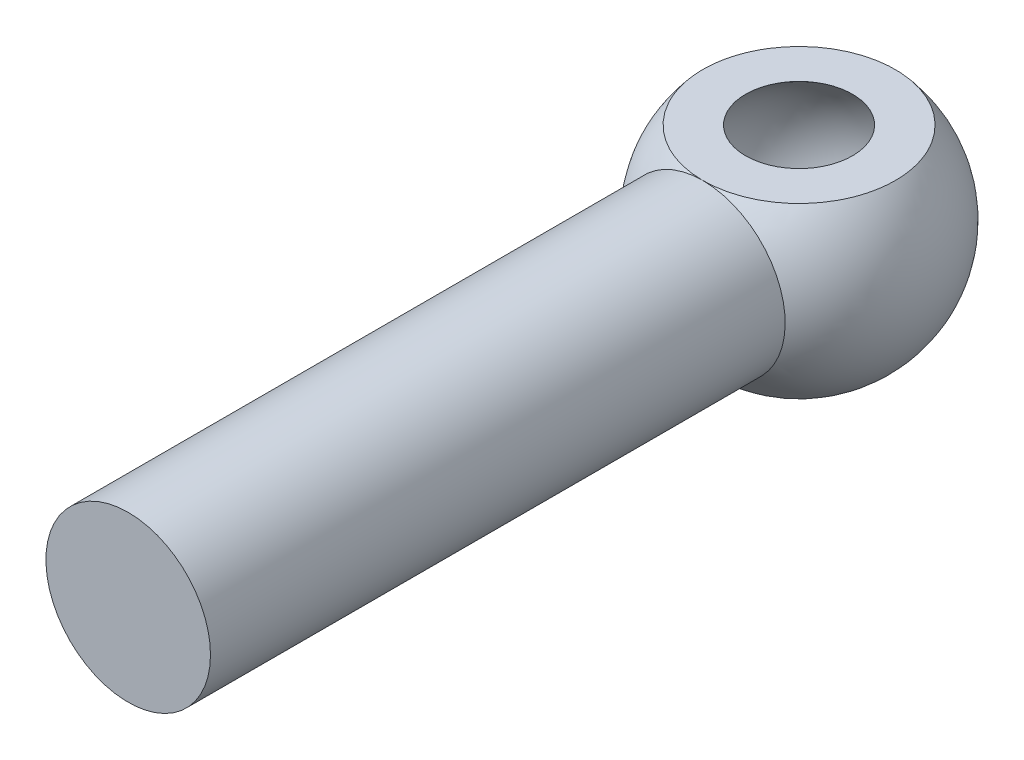
ISO-10303-21;
HEADER;
FILE_DESCRIPTION(('STEP AP214'),'2;1');
FILE_NAME('part.step','',(''),(''),'','','');
FILE_SCHEMA(('AUTOMOTIVE_DESIGN { 1 0 10303 214 1 1 1 1 }'));
ENDSEC;
DATA;
#1=APPLICATION_CONTEXT('core data for automotive mechanical design processes');
#2=APPLICATION_PROTOCOL_DEFINITION('international standard','automotive_design',2000,#1);
#3=PRODUCT_CONTEXT('',#1,'mechanical');
#4=PRODUCT('Part','Part','',(#3));
#5=PRODUCT_RELATED_PRODUCT_CATEGORY('part','',(#4));
#6=PRODUCT_DEFINITION_FORMATION('','',#4);
#7=PRODUCT_DEFINITION_CONTEXT('part definition',#1,'design');
#8=PRODUCT_DEFINITION('design','',#6,#7);
#9=PRODUCT_DEFINITION_SHAPE('','',#8);
#10=(LENGTH_UNIT() NAMED_UNIT(*) SI_UNIT(.MILLI.,.METRE.));
#11=(NAMED_UNIT(*) PLANE_ANGLE_UNIT() SI_UNIT($,.RADIAN.));
#12=(NAMED_UNIT(*) SI_UNIT($,.STERADIAN.) SOLID_ANGLE_UNIT());
#13=UNCERTAINTY_MEASURE_WITH_UNIT(LENGTH_MEASURE(1.E-05),#10,'distance_accuracy_value','');
#14=(GEOMETRIC_REPRESENTATION_CONTEXT(3) GLOBAL_UNCERTAINTY_ASSIGNED_CONTEXT((#13)) GLOBAL_UNIT_ASSIGNED_CONTEXT((#10,
#11,#12)) REPRESENTATION_CONTEXT('',''));
#15=CARTESIAN_POINT('',(0.,0.,0.));
#16=DIRECTION('',(0.,0.,1.));
#17=DIRECTION('',(1.,0.,0.));
#18=AXIS2_PLACEMENT_3D('',#15,#16,#17);
#19=CARTESIAN_POINT('',(0.,1.651,0.));
#20=DIRECTION('',(0.,1.,0.));
#21=DIRECTION('',(0.,0.,1.));
#22=AXIS2_PLACEMENT_3D('',#19,#20,#21);
#23=PLANE('',#22);
#24=CARTESIAN_POINT('',(0.,1.651,0.));
#25=DIRECTION('',(0.,1.,0.));
#26=DIRECTION('',(0.,0.,1.));
#27=AXIS2_PLACEMENT_3D('',#24,#25,#26);
#28=CIRCLE('',#27,1.93023288750347);
#29=CARTESIAN_POINT('',(0.,1.651,1.93023288750347));
#30=VERTEX_POINT('',#29);
#31=EDGE_CURVE('E44',#30,#30,#28,.F.);
#32=ORIENTED_EDGE('',*,*,#31,.F.);
#33=EDGE_LOOP('',(#32));
#34=FACE_BOUND('',#33,.T.);
#35=CARTESIAN_POINT('',(0.,1.651,0.));
#36=DIRECTION('',(0.,1.,0.));
#37=DIRECTION('',(0.,0.,1.));
#38=AXIS2_PLACEMENT_3D('',#35,#36,#37);
#39=CIRCLE('',#38,1.07200338152452);
#40=CARTESIAN_POINT('',(0.,1.651,1.07200338152452));
#41=VERTEX_POINT('',#40);
#42=EDGE_CURVE('E35',#41,#41,#39,.F.);
#43=ORIENTED_EDGE('',*,*,#42,.T.);
#44=EDGE_LOOP('',(#43));
#45=FACE_BOUND('',#44,.T.);
#46=ADVANCED_FACE('F31',(#34,#45),#23,.T.);
#47=CARTESIAN_POINT('',(0.,0.,0.));
#48=DIRECTION('',(-1.,0.,0.));
#49=DIRECTION('',(0.,-1.,0.));
#50=AXIS2_PLACEMENT_3D('',#47,#48,#49);
#51=SPHERICAL_SURFACE('',#50,2.54);
#52=CARTESIAN_POINT('',(0.,0.,1.93023288750347));
#53=DIRECTION('',(0.,0.,-1.));
#54=DIRECTION('',(-1.,0.,0.));
#55=AXIS2_PLACEMENT_3D('',#52,#53,#54);
#56=CIRCLE('',#55,1.651);
#57=EDGE_CURVE('E39',#30,#30,#56,.F.);
#58=ORIENTED_EDGE('',*,*,#57,.F.);
#59=ORIENTED_EDGE('',*,*,#31,.T.);
#60=EDGE_LOOP('',(#58,#59));
#61=FACE_BOUND('',#60,.T.);
#62=ADVANCED_FACE('F63',(#61),#51,.T.);
#63=CARTESIAN_POINT('',(0.,0.,13.462));
#64=DIRECTION('',(0.,0.,-1.));
#65=DIRECTION('',(-1.,0.,0.));
#66=AXIS2_PLACEMENT_3D('',#63,#64,#65);
#67=CYLINDRICAL_SURFACE('',#66,1.651);
#68=ORIENTED_EDGE('',*,*,#57,.T.);
#69=EDGE_LOOP('',(#68));
#70=FACE_BOUND('',#69,.T.);
#71=CARTESIAN_POINT('',(0.,0.,13.462));
#72=DIRECTION('',(0.,0.,1.));
#73=DIRECTION('',(1.,0.,0.));
#74=AXIS2_PLACEMENT_3D('',#71,#72,#73);
#75=CIRCLE('',#74,1.651);
#76=CARTESIAN_POINT('',(1.651,0.,13.462));
#77=VERTEX_POINT('',#76);
#78=EDGE_CURVE('E11',#77,#77,#75,.T.);
#79=ORIENTED_EDGE('',*,*,#78,.F.);
#80=EDGE_LOOP('',(#79));
#81=FACE_BOUND('',#80,.T.);
#82=ADVANCED_FACE('F33',(#70,#81),#67,.T.);
#83=CARTESIAN_POINT('',(0.,0.,13.462));
#84=DIRECTION('',(0.,0.,1.));
#85=DIRECTION('',(1.,0.,0.));
#86=AXIS2_PLACEMENT_3D('',#83,#84,#85);
#87=PLANE('',#86);
#88=ORIENTED_EDGE('',*,*,#78,.T.);
#89=EDGE_LOOP('',(#88));
#90=FACE_BOUND('',#89,.T.);
#91=ADVANCED_FACE('F55',(#90),#87,.T.);
#92=CARTESIAN_POINT('',(0.,0.,0.));
#93=DIRECTION('',(0.,0.,1.));
#94=DIRECTION('',(-1.,0.,0.));
#95=AXIS2_PLACEMENT_3D('',#92,#93,#94);
#96=SPHERICAL_SURFACE('',#95,1.9685);
#97=CARTESIAN_POINT('',(0.,0.,0.));
#98=DIRECTION('',(0.,1.,0.));
#99=DIRECTION('',(0.,0.,1.));
#100=AXIS2_PLACEMENT_3D('',#97,#98,#99);
#101=SPHERICAL_SURFACE('',#100,1.9685);
#102=ORIENTED_EDGE('',*,*,#42,.F.);
#103=EDGE_LOOP('',(#102));
#104=FACE_BOUND('',#103,.T.);
#105=ADVANCED_FACE('F53',(#104),#101,.F.);
#106=CLOSED_SHELL('',(#46,#62,#82,#91,#105));
#107=MANIFOLD_SOLID_BREP('B2',#106);
#108=ADVANCED_BREP_SHAPE_REPRESENTATION('',(#18,#107),#14);
#109=SHAPE_DEFINITION_REPRESENTATION(#9,#108);
ENDSEC;
END-ISO-10303-21;
